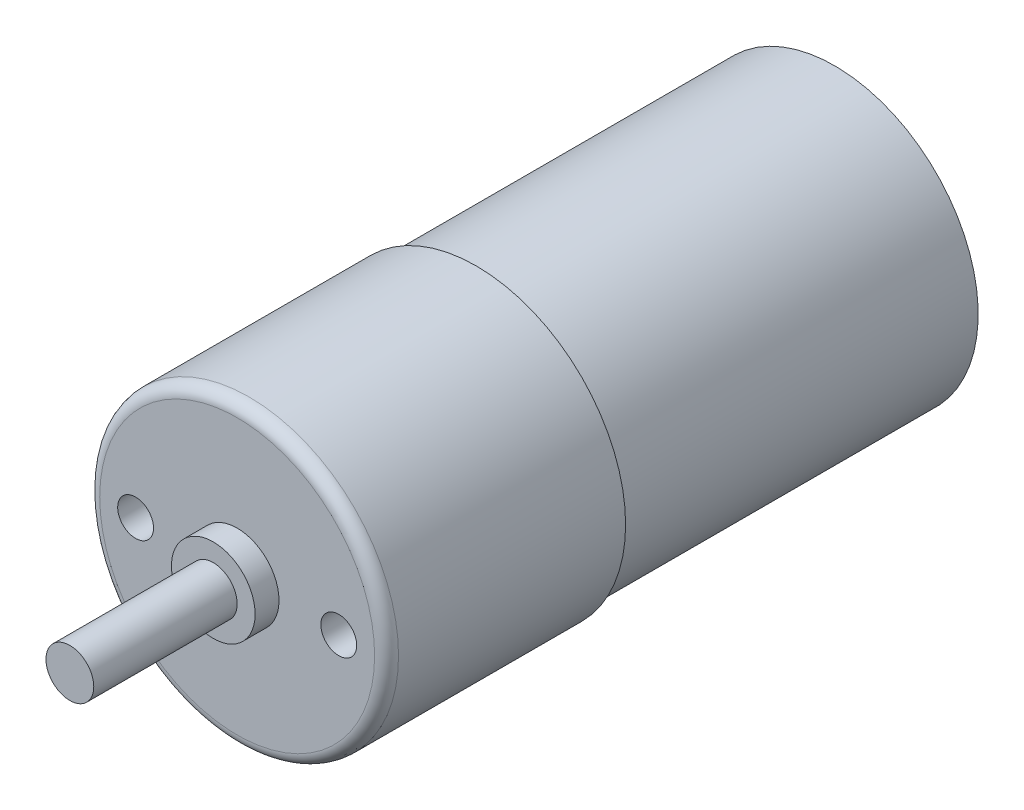
ISO-10303-21;
HEADER;
FILE_DESCRIPTION(('STEP AP214'),'2;1');
FILE_NAME('part.step','',(''),(''),'','','');
FILE_SCHEMA(('AUTOMOTIVE_DESIGN { 1 0 10303 214 1 1 1 1 }'));
ENDSEC;
DATA;
#1=APPLICATION_CONTEXT('core data for automotive mechanical design processes');
#2=APPLICATION_PROTOCOL_DEFINITION('international standard','automotive_design',2000,#1);
#3=PRODUCT_CONTEXT('',#1,'mechanical');
#4=PRODUCT('Part','Part','',(#3));
#5=PRODUCT_RELATED_PRODUCT_CATEGORY('part','',(#4));
#6=PRODUCT_DEFINITION_FORMATION('','',#4);
#7=PRODUCT_DEFINITION_CONTEXT('part definition',#1,'design');
#8=PRODUCT_DEFINITION('design','',#6,#7);
#9=PRODUCT_DEFINITION_SHAPE('','',#8);
#10=(LENGTH_UNIT() NAMED_UNIT(*) SI_UNIT(.MILLI.,.METRE.));
#11=(NAMED_UNIT(*) PLANE_ANGLE_UNIT() SI_UNIT($,.RADIAN.));
#12=(NAMED_UNIT(*) SI_UNIT($,.STERADIAN.) SOLID_ANGLE_UNIT());
#13=UNCERTAINTY_MEASURE_WITH_UNIT(LENGTH_MEASURE(1.E-05),#10,'distance_accuracy_value','');
#14=(GEOMETRIC_REPRESENTATION_CONTEXT(3) GLOBAL_UNCERTAINTY_ASSIGNED_CONTEXT((#13)) GLOBAL_UNIT_ASSIGNED_CONTEXT((#10,
#11,#12)) REPRESENTATION_CONTEXT('',''));
#15=CARTESIAN_POINT('',(0.,0.,0.));
#16=DIRECTION('',(0.,0.,1.));
#17=DIRECTION('',(1.,0.,0.));
#18=AXIS2_PLACEMENT_3D('',#15,#16,#17);
#19=CARTESIAN_POINT('',(0.,0.,50.));
#20=DIRECTION('',(0.,0.,-1.));
#21=DIRECTION('',(-1.,0.,0.));
#22=AXIS2_PLACEMENT_3D('',#19,#20,#21);
#23=CYLINDRICAL_SURFACE('',#22,12.5);
#24=CARTESIAN_POINT('',(0.,0.,49.));
#25=DIRECTION('',(0.,0.,1.));
#26=DIRECTION('',(1.,0.,0.));
#27=AXIS2_PLACEMENT_3D('',#24,#25,#26);
#28=CIRCLE('',#27,12.5);
#29=CARTESIAN_POINT('',(12.5,0.,49.));
#30=VERTEX_POINT('',#29);
#31=EDGE_CURVE('E52',#30,#30,#28,.F.);
#32=ORIENTED_EDGE('',*,*,#31,.T.);
#33=EDGE_LOOP('',(#32));
#34=FACE_BOUND('',#33,.T.);
#35=CARTESIAN_POINT('',(0.,0.,30.));
#36=DIRECTION('',(0.,0.,-1.));
#37=DIRECTION('',(-1.,0.,0.));
#38=AXIS2_PLACEMENT_3D('',#35,#36,#37);
#39=CIRCLE('',#38,12.5);
#40=CARTESIAN_POINT('',(-12.5,0.,30.));
#41=VERTEX_POINT('',#40);
#42=EDGE_CURVE('E72',#41,#41,#39,.T.);
#43=ORIENTED_EDGE('',*,*,#42,.F.);
#44=EDGE_LOOP('',(#43));
#45=FACE_BOUND('',#44,.T.);
#46=ADVANCED_FACE('F37',(#34,#45),#23,.T.);
#47=CARTESIAN_POINT('',(0.,0.,50.));
#48=DIRECTION('',(0.,0.,1.));
#49=DIRECTION('',(1.,0.,0.));
#50=AXIS2_PLACEMENT_3D('',#47,#48,#49);
#51=PLANE('',#50);
#52=CARTESIAN_POINT('',(8.5,0.,50.));
#53=DIRECTION('',(0.,0.,1.));
#54=DIRECTION('',(1.,0.,0.));
#55=AXIS2_PLACEMENT_3D('',#52,#53,#54);
#56=CIRCLE('',#55,1.5);
#57=CARTESIAN_POINT('',(10.,0.,50.));
#58=VERTEX_POINT('',#57);
#59=EDGE_CURVE('E88',#58,#58,#56,.T.);
#60=ORIENTED_EDGE('',*,*,#59,.F.);
#61=EDGE_LOOP('',(#60));
#62=FACE_BOUND('',#61,.T.);
#63=CARTESIAN_POINT('',(-8.5,0.,50.));
#64=DIRECTION('',(0.,0.,1.));
#65=DIRECTION('',(-1.,0.,0.));
#66=AXIS2_PLACEMENT_3D('',#63,#64,#65);
#67=CIRCLE('',#66,1.5);
#68=CARTESIAN_POINT('',(-10.,0.,50.));
#69=VERTEX_POINT('',#68);
#70=EDGE_CURVE('E85',#69,#69,#67,.T.);
#71=ORIENTED_EDGE('',*,*,#70,.F.);
#72=EDGE_LOOP('',(#71));
#73=FACE_BOUND('',#72,.T.);
#74=CARTESIAN_POINT('',(0.,0.,50.));
#75=DIRECTION('',(0.,0.,1.));
#76=DIRECTION('',(1.,0.,0.));
#77=AXIS2_PLACEMENT_3D('',#74,#75,#76);
#78=CIRCLE('',#77,11.5);
#79=CARTESIAN_POINT('',(11.5,0.,50.));
#80=VERTEX_POINT('',#79);
#81=EDGE_CURVE('E57',#80,#80,#78,.T.);
#82=ORIENTED_EDGE('',*,*,#81,.T.);
#83=EDGE_LOOP('',(#82));
#84=FACE_BOUND('',#83,.T.);
#85=CARTESIAN_POINT('',(0.,0.,50.));
#86=DIRECTION('',(0.,0.,1.));
#87=DIRECTION('',(1.,0.,0.));
#88=AXIS2_PLACEMENT_3D('',#85,#86,#87);
#89=CIRCLE('',#88,3.5);
#90=CARTESIAN_POINT('',(3.5,0.,50.));
#91=VERTEX_POINT('',#90);
#92=EDGE_CURVE('E61',#91,#91,#89,.T.);
#93=ORIENTED_EDGE('',*,*,#92,.F.);
#94=EDGE_LOOP('',(#93));
#95=FACE_BOUND('',#94,.T.);
#96=ADVANCED_FACE('F103',(#62,#73,#84,#95),#51,.T.);
#97=CARTESIAN_POINT('',(0.,0.,52.));
#98=DIRECTION('',(0.,0.,-1.));
#99=DIRECTION('',(-1.,0.,0.));
#100=AXIS2_PLACEMENT_3D('',#97,#98,#99);
#101=CYLINDRICAL_SURFACE('',#100,3.5);
#102=CARTESIAN_POINT('',(0.,0.,52.));
#103=DIRECTION('',(0.,0.,1.));
#104=DIRECTION('',(1.,0.,0.));
#105=AXIS2_PLACEMENT_3D('',#102,#103,#104);
#106=CIRCLE('',#105,3.5);
#107=CARTESIAN_POINT('',(3.5,0.,52.));
#108=VERTEX_POINT('',#107);
#109=EDGE_CURVE('E64',#108,#108,#106,.T.);
#110=ORIENTED_EDGE('',*,*,#109,.F.);
#111=EDGE_LOOP('',(#110));
#112=FACE_BOUND('',#111,.T.);
#113=ORIENTED_EDGE('',*,*,#92,.T.);
#114=EDGE_LOOP('',(#113));
#115=FACE_BOUND('',#114,.T.);
#116=ADVANCED_FACE('F106',(#112,#115),#101,.T.);
#117=CARTESIAN_POINT('',(0.,0.,52.));
#118=DIRECTION('',(0.,0.,1.));
#119=DIRECTION('',(1.,0.,0.));
#120=AXIS2_PLACEMENT_3D('',#117,#118,#119);
#121=PLANE('',#120);
#122=CARTESIAN_POINT('',(0.,0.,52.));
#123=DIRECTION('',(0.,0.,1.));
#124=DIRECTION('',(1.,0.,0.));
#125=AXIS2_PLACEMENT_3D('',#122,#123,#124);
#126=CIRCLE('',#125,2.);
#127=CARTESIAN_POINT('',(2.,0.,52.));
#128=VERTEX_POINT('',#127);
#129=EDGE_CURVE('E60',#128,#128,#126,.T.);
#130=ORIENTED_EDGE('',*,*,#129,.F.);
#131=EDGE_LOOP('',(#130));
#132=FACE_BOUND('',#131,.T.);
#133=ORIENTED_EDGE('',*,*,#109,.T.);
#134=EDGE_LOOP('',(#133));
#135=FACE_BOUND('',#134,.T.);
#136=ADVANCED_FACE('F115',(#132,#135),#121,.T.);
#137=CARTESIAN_POINT('',(0.,0.,64.));
#138=DIRECTION('',(0.,0.,-1.));
#139=DIRECTION('',(-1.,0.,0.));
#140=AXIS2_PLACEMENT_3D('',#137,#138,#139);
#141=CYLINDRICAL_SURFACE('',#140,2.);
#142=CARTESIAN_POINT('',(0.,0.,64.));
#143=DIRECTION('',(0.,0.,1.));
#144=DIRECTION('',(1.,0.,0.));
#145=AXIS2_PLACEMENT_3D('',#142,#143,#144);
#146=CIRCLE('',#145,2.);
#147=CARTESIAN_POINT('',(2.,0.,64.));
#148=VERTEX_POINT('',#147);
#149=EDGE_CURVE('E67',#148,#148,#146,.T.);
#150=ORIENTED_EDGE('',*,*,#149,.F.);
#151=EDGE_LOOP('',(#150));
#152=FACE_BOUND('',#151,.T.);
#153=ORIENTED_EDGE('',*,*,#129,.T.);
#154=EDGE_LOOP('',(#153));
#155=FACE_BOUND('',#154,.T.);
#156=ADVANCED_FACE('F121',(#152,#155),#141,.T.);
#157=CARTESIAN_POINT('',(0.,0.,64.));
#158=DIRECTION('',(0.,0.,1.));
#159=DIRECTION('',(1.,0.,0.));
#160=AXIS2_PLACEMENT_3D('',#157,#158,#159);
#161=PLANE('',#160);
#162=ORIENTED_EDGE('',*,*,#149,.T.);
#163=EDGE_LOOP('',(#162));
#164=FACE_BOUND('',#163,.T.);
#165=ADVANCED_FACE('F161',(#164),#161,.T.);
#166=CARTESIAN_POINT('',(0.,0.,30.));
#167=DIRECTION('',(0.,0.,-1.));
#168=DIRECTION('',(-1.,0.,0.));
#169=AXIS2_PLACEMENT_3D('',#166,#167,#168);
#170=PLANE('',#169);
#171=CARTESIAN_POINT('',(0.,0.,30.));
#172=DIRECTION('',(0.,0.,-1.));
#173=DIRECTION('',(-1.,0.,0.));
#174=AXIS2_PLACEMENT_3D('',#171,#172,#173);
#175=CIRCLE('',#174,12.);
#176=CARTESIAN_POINT('',(-12.,0.,30.));
#177=VERTEX_POINT('',#176);
#178=EDGE_CURVE('E75',#177,#177,#175,.T.);
#179=ORIENTED_EDGE('',*,*,#178,.F.);
#180=EDGE_LOOP('',(#179));
#181=FACE_BOUND('',#180,.T.);
#182=ORIENTED_EDGE('',*,*,#42,.T.);
#183=EDGE_LOOP('',(#182));
#184=FACE_BOUND('',#183,.T.);
#185=ADVANCED_FACE('F150',(#181,#184),#170,.T.);
#186=CARTESIAN_POINT('',(0.,0.,30.));
#187=DIRECTION('',(0.,0.,-1.));
#188=DIRECTION('',(-1.,0.,0.));
#189=AXIS2_PLACEMENT_3D('',#186,#187,#188);
#190=CYLINDRICAL_SURFACE('',#189,12.);
#191=ORIENTED_EDGE('',*,*,#178,.T.);
#192=EDGE_LOOP('',(#191));
#193=FACE_BOUND('',#192,.T.);
#194=CARTESIAN_POINT('',(0.,0.,0.));
#195=DIRECTION('',(0.,0.,-1.));
#196=DIRECTION('',(-1.,0.,0.));
#197=AXIS2_PLACEMENT_3D('',#194,#195,#196);
#198=CIRCLE('',#197,12.);
#199=CARTESIAN_POINT('',(-12.,0.,0.));
#200=VERTEX_POINT('',#199);
#201=EDGE_CURVE('E76',#200,#200,#198,.T.);
#202=ORIENTED_EDGE('',*,*,#201,.F.);
#203=EDGE_LOOP('',(#202));
#204=FACE_BOUND('',#203,.T.);
#205=ADVANCED_FACE('F143',(#193,#204),#190,.T.);
#206=CARTESIAN_POINT('',(0.,0.,0.));
#207=DIRECTION('',(0.,0.,1.));
#208=DIRECTION('',(1.,0.,0.));
#209=AXIS2_PLACEMENT_3D('',#206,#207,#208);
#210=PLANE('',#209);
#211=CARTESIAN_POINT('',(0.,0.,0.));
#212=DIRECTION('',(0.,0.,-1.));
#213=DIRECTION('',(-1.,0.,0.));
#214=AXIS2_PLACEMENT_3D('',#211,#212,#213);
#215=CIRCLE('',#214,3.07076098267715);
#216=CARTESIAN_POINT('',(-3.07076098267715,0.,0.));
#217=VERTEX_POINT('',#216);
#218=EDGE_CURVE('E48',#217,#217,#215,.T.);
#219=ORIENTED_EDGE('',*,*,#218,.F.);
#220=EDGE_LOOP('',(#219));
#221=FACE_BOUND('',#220,.T.);
#222=ORIENTED_EDGE('',*,*,#201,.T.);
#223=EDGE_LOOP('',(#222));
#224=FACE_BOUND('',#223,.T.);
#225=ADVANCED_FACE('F132',(#221,#224),#210,.F.);
#226=CARTESIAN_POINT('',(0.,0.,49.));
#227=DIRECTION('',(0.,0.,1.));
#228=DIRECTION('',(1.,0.,0.));
#229=AXIS2_PLACEMENT_3D('',#226,#227,#228);
#230=TOROIDAL_SURFACE('',#229,11.5,1.);
#231=ORIENTED_EDGE('',*,*,#31,.F.);
#232=EDGE_LOOP('',(#231));
#233=FACE_BOUND('',#232,.T.);
#234=ORIENTED_EDGE('',*,*,#81,.F.);
#235=EDGE_LOOP('',(#234));
#236=FACE_BOUND('',#235,.T.);
#237=ADVANCED_FACE('F133',(#233,#236),#230,.T.);
#238=CARTESIAN_POINT('',(0.,0.,-1.));
#239=DIRECTION('',(0.,0.,1.));
#240=DIRECTION('',(1.,0.,0.));
#241=AXIS2_PLACEMENT_3D('',#238,#239,#240);
#242=CYLINDRICAL_SURFACE('',#241,3.07076098267715);
#243=CARTESIAN_POINT('',(0.,0.,-0.5));
#244=DIRECTION('',(0.,0.,-1.));
#245=DIRECTION('',(-1.,0.,0.));
#246=AXIS2_PLACEMENT_3D('',#243,#244,#245);
#247=CIRCLE('',#246,3.07076098267715);
#248=CARTESIAN_POINT('',(-3.07076098267715,0.,-0.5));
#249=VERTEX_POINT('',#248);
#250=EDGE_CURVE('E10',#249,#249,#247,.F.);
#251=ORIENTED_EDGE('',*,*,#250,.T.);
#252=EDGE_LOOP('',(#251));
#253=FACE_BOUND('',#252,.T.);
#254=ORIENTED_EDGE('',*,*,#218,.T.);
#255=EDGE_LOOP('',(#254));
#256=FACE_BOUND('',#255,.T.);
#257=ADVANCED_FACE('F135',(#253,#256),#242,.T.);
#258=CARTESIAN_POINT('',(0.,0.,-1.));
#259=DIRECTION('',(0.,0.,-1.));
#260=DIRECTION('',(-1.,0.,0.));
#261=AXIS2_PLACEMENT_3D('',#258,#259,#260);
#262=PLANE('',#261);
#263=CARTESIAN_POINT('',(0.,0.,-1.));
#264=DIRECTION('',(0.,0.,-1.));
#265=DIRECTION('',(-1.,0.,0.));
#266=AXIS2_PLACEMENT_3D('',#263,#264,#265);
#267=CIRCLE('',#266,2.57076098267715);
#268=CARTESIAN_POINT('',(-2.57076098267715,0.,-1.));
#269=VERTEX_POINT('',#268);
#270=EDGE_CURVE('E44',#269,#269,#267,.T.);
#271=ORIENTED_EDGE('',*,*,#270,.T.);
#272=EDGE_LOOP('',(#271));
#273=FACE_BOUND('',#272,.T.);
#274=ADVANCED_FACE('F141',(#273),#262,.T.);
#275=CARTESIAN_POINT('',(0.,0.,-0.5));
#276=DIRECTION('',(0.,0.,-1.));
#277=DIRECTION('',(-1.,0.,0.));
#278=AXIS2_PLACEMENT_3D('',#275,#276,#277);
#279=TOROIDAL_SURFACE('',#278,2.57076098267715,0.5);
#280=ORIENTED_EDGE('',*,*,#250,.F.);
#281=EDGE_LOOP('',(#280));
#282=FACE_BOUND('',#281,.T.);
#283=ORIENTED_EDGE('',*,*,#270,.F.);
#284=EDGE_LOOP('',(#283));
#285=FACE_BOUND('',#284,.T.);
#286=ADVANCED_FACE('F39',(#282,#285),#279,.T.);
#287=CARTESIAN_POINT('',(-8.5,0.,40.));
#288=DIRECTION('',(0.,0.,1.));
#289=DIRECTION('',(1.,0.,0.));
#290=AXIS2_PLACEMENT_3D('',#287,#288,#289);
#291=CYLINDRICAL_SURFACE('',#290,1.5);
#292=CARTESIAN_POINT('',(-8.5,0.,40.));
#293=DIRECTION('',(0.,0.,1.));
#294=DIRECTION('',(-1.,0.,0.));
#295=AXIS2_PLACEMENT_3D('',#292,#293,#294);
#296=CIRCLE('',#295,1.5);
#297=CARTESIAN_POINT('',(-10.,0.,40.));
#298=VERTEX_POINT('',#297);
#299=EDGE_CURVE('E82',#298,#298,#296,.T.);
#300=ORIENTED_EDGE('',*,*,#299,.F.);
#301=EDGE_LOOP('',(#300));
#302=FACE_BOUND('',#301,.T.);
#303=ORIENTED_EDGE('',*,*,#70,.T.);
#304=EDGE_LOOP('',(#303));
#305=FACE_BOUND('',#304,.T.);
#306=ADVANCED_FACE('F234',(#302,#305),#291,.F.);
#307=CARTESIAN_POINT('',(-8.5,0.,40.));
#308=DIRECTION('',(0.,0.,-1.));
#309=DIRECTION('',(-1.,0.,0.));
#310=AXIS2_PLACEMENT_3D('',#307,#308,#309);
#311=PLANE('',#310);
#312=ORIENTED_EDGE('',*,*,#299,.T.);
#313=EDGE_LOOP('',(#312));
#314=FACE_BOUND('',#313,.T.);
#315=ADVANCED_FACE('F99',(#314),#311,.F.);
#316=CARTESIAN_POINT('',(8.5,0.,40.));
#317=DIRECTION('',(0.,0.,1.));
#318=DIRECTION('',(1.,0.,0.));
#319=AXIS2_PLACEMENT_3D('',#316,#317,#318);
#320=CYLINDRICAL_SURFACE('',#319,1.5);
#321=CARTESIAN_POINT('',(8.5,0.,40.));
#322=DIRECTION('',(0.,0.,1.));
#323=DIRECTION('',(1.,0.,0.));
#324=AXIS2_PLACEMENT_3D('',#321,#322,#323);
#325=CIRCLE('',#324,1.5);
#326=CARTESIAN_POINT('',(10.,0.,40.));
#327=VERTEX_POINT('',#326);
#328=EDGE_CURVE('E79',#327,#327,#325,.T.);
#329=ORIENTED_EDGE('',*,*,#328,.F.);
#330=EDGE_LOOP('',(#329));
#331=FACE_BOUND('',#330,.T.);
#332=ORIENTED_EDGE('',*,*,#59,.T.);
#333=EDGE_LOOP('',(#332));
#334=FACE_BOUND('',#333,.T.);
#335=ADVANCED_FACE('F96',(#331,#334),#320,.F.);
#336=CARTESIAN_POINT('',(8.5,0.,40.));
#337=DIRECTION('',(0.,0.,1.));
#338=DIRECTION('',(1.,0.,0.));
#339=AXIS2_PLACEMENT_3D('',#336,#337,#338);
#340=PLANE('',#339);
#341=ORIENTED_EDGE('',*,*,#328,.T.);
#342=EDGE_LOOP('',(#341));
#343=FACE_BOUND('',#342,.T.);
#344=ADVANCED_FACE('F94',(#343),#340,.T.);
#345=CLOSED_SHELL('',(#46,#96,#116,#136,#156,#165,#185,#205,#225,#237,#257,#274,#286,#306,#315,
#335,#344));
#346=MANIFOLD_SOLID_BREP('B2',#345);
#347=ADVANCED_BREP_SHAPE_REPRESENTATION('',(#18,#346),#14);
#348=SHAPE_DEFINITION_REPRESENTATION(#9,#347);
ENDSEC;
END-ISO-10303-21;
